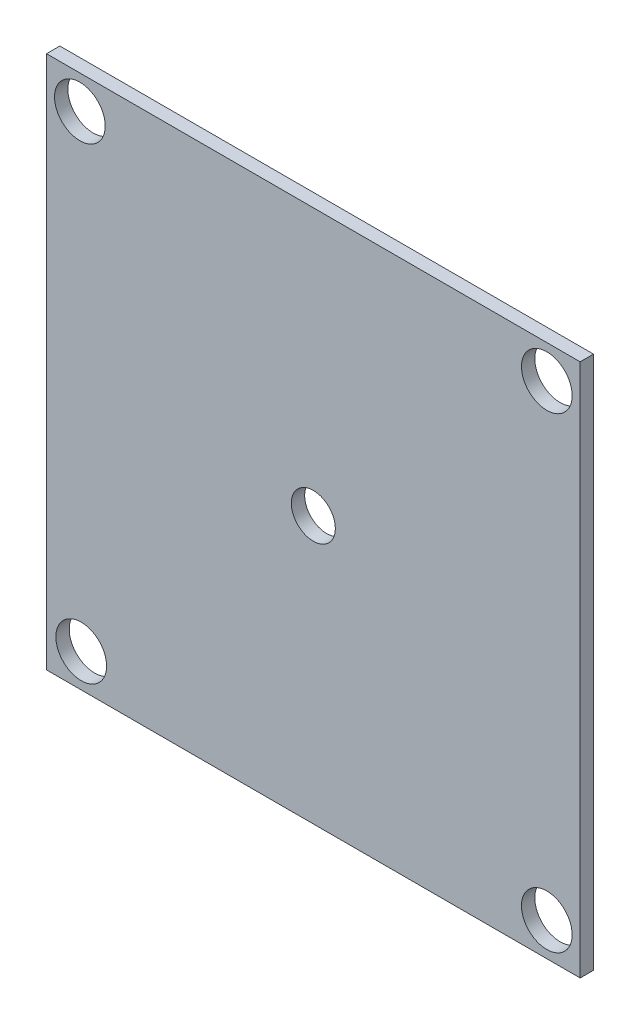
ISO-10303-21;
HEADER;
FILE_DESCRIPTION(('STEP AP214'),'2;1');
FILE_NAME('part.step','',(''),(''),'','','');
FILE_SCHEMA(('AUTOMOTIVE_DESIGN { 1 0 10303 214 1 1 1 1 }'));
ENDSEC;
DATA;
#1=APPLICATION_CONTEXT('core data for automotive mechanical design processes');
#2=APPLICATION_PROTOCOL_DEFINITION('international standard','automotive_design',2000,#1);
#3=PRODUCT_CONTEXT('',#1,'mechanical');
#4=PRODUCT('Part','Part','',(#3));
#5=PRODUCT_RELATED_PRODUCT_CATEGORY('part','',(#4));
#6=PRODUCT_DEFINITION_FORMATION('','',#4);
#7=PRODUCT_DEFINITION_CONTEXT('part definition',#1,'design');
#8=PRODUCT_DEFINITION('design','',#6,#7);
#9=PRODUCT_DEFINITION_SHAPE('','',#8);
#10=(LENGTH_UNIT() NAMED_UNIT(*) SI_UNIT(.MILLI.,.METRE.));
#11=(NAMED_UNIT(*) PLANE_ANGLE_UNIT() SI_UNIT($,.RADIAN.));
#12=(NAMED_UNIT(*) SI_UNIT($,.STERADIAN.) SOLID_ANGLE_UNIT());
#13=UNCERTAINTY_MEASURE_WITH_UNIT(LENGTH_MEASURE(1.E-05),#10,'distance_accuracy_value','');
#14=(GEOMETRIC_REPRESENTATION_CONTEXT(3) GLOBAL_UNCERTAINTY_ASSIGNED_CONTEXT((#13)) GLOBAL_UNIT_ASSIGNED_CONTEXT((#10,
#11,#12)) REPRESENTATION_CONTEXT('',''));
#15=CARTESIAN_POINT('',(0.,0.,0.));
#16=DIRECTION('',(0.,0.,1.));
#17=DIRECTION('',(1.,0.,0.));
#18=AXIS2_PLACEMENT_3D('',#15,#16,#17);
#19=CARTESIAN_POINT('',(-50.8,-50.8,2.54));
#20=DIRECTION('',(1.,0.,0.));
#21=DIRECTION('',(0.,0.,-1.));
#22=AXIS2_PLACEMENT_3D('',#19,#20,#21);
#23=PLANE('',#22);
#24=DIRECTION('',(0.,-1.,0.));
#25=VECTOR('',#24,1.);
#26=CARTESIAN_POINT('',(-50.8,-50.8,0.));
#27=LINE('',#26,#25);
#28=CARTESIAN_POINT('',(-50.8,50.8,0.));
#29=VERTEX_POINT('',#28);
#30=CARTESIAN_POINT('',(-50.8,-50.8,0.));
#31=VERTEX_POINT('',#30);
#32=EDGE_CURVE('E96',#29,#31,#27,.T.);
#33=ORIENTED_EDGE('',*,*,#32,.T.);
#34=DIRECTION('',(0.,0.,-1.));
#35=VECTOR('',#34,1.);
#36=CARTESIAN_POINT('',(-50.8,-50.8,2.54));
#37=LINE('',#36,#35);
#38=CARTESIAN_POINT('',(-50.8,-50.8,2.54));
#39=VERTEX_POINT('',#38);
#40=EDGE_CURVE('E11',#39,#31,#37,.T.);
#41=ORIENTED_EDGE('',*,*,#40,.F.);
#42=DIRECTION('',(0.,-1.,0.));
#43=VECTOR('',#42,1.);
#44=CARTESIAN_POINT('',(-50.8,-50.8,2.54));
#45=LINE('',#44,#43);
#46=CARTESIAN_POINT('',(-50.8,50.8,2.54));
#47=VERTEX_POINT('',#46);
#48=EDGE_CURVE('E84',#47,#39,#45,.T.);
#49=ORIENTED_EDGE('',*,*,#48,.F.);
#50=DIRECTION('',(0.,0.,-1.));
#51=VECTOR('',#50,1.);
#52=CARTESIAN_POINT('',(-50.8,50.8,2.54));
#53=LINE('',#52,#51);
#54=EDGE_CURVE('E92',#47,#29,#53,.T.);
#55=ORIENTED_EDGE('',*,*,#54,.T.);
#56=EDGE_LOOP('',(#33,#41,#49,#55));
#57=FACE_BOUND('',#56,.T.);
#58=ADVANCED_FACE('F33',(#57),#23,.F.);
#59=CARTESIAN_POINT('',(50.8,-50.8,2.54));
#60=DIRECTION('',(0.,1.,0.));
#61=DIRECTION('',(-1.,0.,0.));
#62=AXIS2_PLACEMENT_3D('',#59,#60,#61);
#63=PLANE('',#62);
#64=DIRECTION('',(1.,0.,0.));
#65=VECTOR('',#64,1.);
#66=CARTESIAN_POINT('',(50.8,-50.8,0.));
#67=LINE('',#66,#65);
#68=CARTESIAN_POINT('',(50.8,-50.8,0.));
#69=VERTEX_POINT('',#68);
#70=EDGE_CURVE('E88',#31,#69,#67,.T.);
#71=ORIENTED_EDGE('',*,*,#70,.T.);
#72=DIRECTION('',(0.,0.,-1.));
#73=VECTOR('',#72,1.);
#74=CARTESIAN_POINT('',(50.8,-50.8,2.54));
#75=LINE('',#74,#73);
#76=CARTESIAN_POINT('',(50.8,-50.8,2.54));
#77=VERTEX_POINT('',#76);
#78=EDGE_CURVE('E41',#77,#69,#75,.T.);
#79=ORIENTED_EDGE('',*,*,#78,.F.);
#80=DIRECTION('',(1.,0.,0.));
#81=VECTOR('',#80,1.);
#82=CARTESIAN_POINT('',(50.8,-50.8,2.54));
#83=LINE('',#82,#81);
#84=EDGE_CURVE('E79',#39,#77,#83,.T.);
#85=ORIENTED_EDGE('',*,*,#84,.F.);
#86=ORIENTED_EDGE('',*,*,#40,.T.);
#87=EDGE_LOOP('',(#71,#79,#85,#86));
#88=FACE_BOUND('',#87,.T.);
#89=ADVANCED_FACE('F87',(#88),#63,.F.);
#90=CARTESIAN_POINT('',(50.8,-50.8,2.54));
#91=DIRECTION('',(-1.,0.,0.));
#92=DIRECTION('',(0.,0.,1.));
#93=AXIS2_PLACEMENT_3D('',#90,#91,#92);
#94=PLANE('',#93);
#95=DIRECTION('',(0.,1.,0.));
#96=VECTOR('',#95,1.);
#97=CARTESIAN_POINT('',(50.8,-50.8,0.));
#98=LINE('',#97,#96);
#99=CARTESIAN_POINT('',(50.8,50.8,0.));
#100=VERTEX_POINT('',#99);
#101=EDGE_CURVE('E66',#69,#100,#98,.T.);
#102=ORIENTED_EDGE('',*,*,#101,.T.);
#103=DIRECTION('',(0.,0.,-1.));
#104=VECTOR('',#103,1.);
#105=CARTESIAN_POINT('',(50.8,50.8,2.54));
#106=LINE('',#105,#104);
#107=CARTESIAN_POINT('',(50.8,50.8,2.54));
#108=VERTEX_POINT('',#107);
#109=EDGE_CURVE('E89',#108,#100,#106,.T.);
#110=ORIENTED_EDGE('',*,*,#109,.F.);
#111=DIRECTION('',(0.,1.,0.));
#112=VECTOR('',#111,1.);
#113=CARTESIAN_POINT('',(50.8,-50.8,2.54));
#114=LINE('',#113,#112);
#115=EDGE_CURVE('E82',#77,#108,#114,.T.);
#116=ORIENTED_EDGE('',*,*,#115,.F.);
#117=ORIENTED_EDGE('',*,*,#78,.T.);
#118=EDGE_LOOP('',(#102,#110,#116,#117));
#119=FACE_BOUND('',#118,.T.);
#120=ADVANCED_FACE('F90',(#119),#94,.F.);
#121=CARTESIAN_POINT('',(50.8,50.8,2.54));
#122=DIRECTION('',(0.,-1.,0.));
#123=DIRECTION('',(1.,0.,0.));
#124=AXIS2_PLACEMENT_3D('',#121,#122,#123);
#125=PLANE('',#124);
#126=DIRECTION('',(-1.,0.,0.));
#127=VECTOR('',#126,1.);
#128=CARTESIAN_POINT('',(50.8,50.8,0.));
#129=LINE('',#128,#127);
#130=EDGE_CURVE('E72',#100,#29,#129,.T.);
#131=ORIENTED_EDGE('',*,*,#130,.T.);
#132=ORIENTED_EDGE('',*,*,#54,.F.);
#133=DIRECTION('',(-1.,0.,0.));
#134=VECTOR('',#133,1.);
#135=CARTESIAN_POINT('',(50.8,50.8,2.54));
#136=LINE('',#135,#134);
#137=EDGE_CURVE('E49',#108,#47,#136,.T.);
#138=ORIENTED_EDGE('',*,*,#137,.F.);
#139=ORIENTED_EDGE('',*,*,#109,.T.);
#140=EDGE_LOOP('',(#131,#132,#138,#139));
#141=FACE_BOUND('',#140,.T.);
#142=ADVANCED_FACE('F104',(#141),#125,.F.);
#143=CARTESIAN_POINT('',(0.,0.,2.54));
#144=DIRECTION('',(0.,0.,1.));
#145=DIRECTION('',(1.,0.,0.));
#146=AXIS2_PLACEMENT_3D('',#143,#144,#145);
#147=PLANE('',#146);
#148=CARTESIAN_POINT('',(-44.45,44.45,2.54));
#149=DIRECTION('',(0.,0.,1.));
#150=DIRECTION('',(1.,0.,0.));
#151=AXIS2_PLACEMENT_3D('',#148,#149,#150);
#152=CIRCLE('',#151,4.826);
#153=CARTESIAN_POINT('',(-39.624,44.45,2.54));
#154=VERTEX_POINT('',#153);
#155=EDGE_CURVE('E119',#154,#154,#152,.T.);
#156=ORIENTED_EDGE('',*,*,#155,.F.);
#157=EDGE_LOOP('',(#156));
#158=FACE_BOUND('',#157,.T.);
#159=CARTESIAN_POINT('',(44.45,44.45,2.54));
#160=DIRECTION('',(0.,0.,1.));
#161=DIRECTION('',(1.,0.,0.));
#162=AXIS2_PLACEMENT_3D('',#159,#160,#161);
#163=CIRCLE('',#162,4.826);
#164=CARTESIAN_POINT('',(49.276,44.45,2.54));
#165=VERTEX_POINT('',#164);
#166=EDGE_CURVE('E131',#165,#165,#163,.T.);
#167=ORIENTED_EDGE('',*,*,#166,.F.);
#168=EDGE_LOOP('',(#167));
#169=FACE_BOUND('',#168,.T.);
#170=CARTESIAN_POINT('',(44.45,-44.45,2.54));
#171=DIRECTION('',(0.,0.,1.));
#172=DIRECTION('',(1.,0.,0.));
#173=AXIS2_PLACEMENT_3D('',#170,#171,#172);
#174=CIRCLE('',#173,4.826);
#175=CARTESIAN_POINT('',(49.276,-44.45,2.54));
#176=VERTEX_POINT('',#175);
#177=EDGE_CURVE('E125',#176,#176,#174,.T.);
#178=ORIENTED_EDGE('',*,*,#177,.F.);
#179=EDGE_LOOP('',(#178));
#180=FACE_BOUND('',#179,.T.);
#181=CARTESIAN_POINT('',(-44.1907798423424,-44.45,2.54));
#182=DIRECTION('',(0.,0.,1.));
#183=DIRECTION('',(1.,0.,0.));
#184=AXIS2_PLACEMENT_3D('',#181,#182,#183);
#185=CIRCLE('',#184,4.826);
#186=CARTESIAN_POINT('',(-39.3647798423424,-44.45,2.54));
#187=VERTEX_POINT('',#186);
#188=EDGE_CURVE('E116',#187,#187,#185,.T.);
#189=ORIENTED_EDGE('',*,*,#188,.F.);
#190=EDGE_LOOP('',(#189));
#191=FACE_BOUND('',#190,.T.);
#192=CARTESIAN_POINT('',(0.,0.,2.54));
#193=DIRECTION('',(0.,0.,1.));
#194=DIRECTION('',(1.,0.,0.));
#195=AXIS2_PLACEMENT_3D('',#192,#193,#194);
#196=CIRCLE('',#195,4.191);
#197=CARTESIAN_POINT('',(4.191,0.,2.54));
#198=VERTEX_POINT('',#197);
#199=EDGE_CURVE('E110',#198,#198,#196,.T.);
#200=ORIENTED_EDGE('',*,*,#199,.F.);
#201=EDGE_LOOP('',(#200));
#202=FACE_BOUND('',#201,.T.);
#203=ORIENTED_EDGE('',*,*,#48,.T.);
#204=ORIENTED_EDGE('',*,*,#84,.T.);
#205=ORIENTED_EDGE('',*,*,#115,.T.);
#206=ORIENTED_EDGE('',*,*,#137,.T.);
#207=EDGE_LOOP('',(#203,#204,#205,#206));
#208=FACE_BOUND('',#207,.T.);
#209=ADVANCED_FACE('F80',(#158,#169,#180,#191,#202,#208),#147,.T.);
#210=CARTESIAN_POINT('',(0.,0.,0.));
#211=DIRECTION('',(0.,0.,1.));
#212=DIRECTION('',(1.,0.,0.));
#213=AXIS2_PLACEMENT_3D('',#210,#211,#212);
#214=PLANE('',#213);
#215=CARTESIAN_POINT('',(-44.45,44.45,0.));
#216=DIRECTION('',(0.,0.,1.));
#217=DIRECTION('',(1.,0.,0.));
#218=AXIS2_PLACEMENT_3D('',#215,#216,#217);
#219=CIRCLE('',#218,4.826);
#220=CARTESIAN_POINT('',(-39.624,44.45,0.));
#221=VERTEX_POINT('',#220);
#222=EDGE_CURVE('E134',#221,#221,#219,.T.);
#223=ORIENTED_EDGE('',*,*,#222,.T.);
#224=EDGE_LOOP('',(#223));
#225=FACE_BOUND('',#224,.T.);
#226=CARTESIAN_POINT('',(44.45,44.45,0.));
#227=DIRECTION('',(0.,0.,1.));
#228=DIRECTION('',(1.,0.,0.));
#229=AXIS2_PLACEMENT_3D('',#226,#227,#228);
#230=CIRCLE('',#229,4.826);
#231=CARTESIAN_POINT('',(49.276,44.45,0.));
#232=VERTEX_POINT('',#231);
#233=EDGE_CURVE('E128',#232,#232,#230,.T.);
#234=ORIENTED_EDGE('',*,*,#233,.T.);
#235=EDGE_LOOP('',(#234));
#236=FACE_BOUND('',#235,.T.);
#237=CARTESIAN_POINT('',(44.45,-44.45,0.));
#238=DIRECTION('',(0.,0.,1.));
#239=DIRECTION('',(1.,0.,0.));
#240=AXIS2_PLACEMENT_3D('',#237,#238,#239);
#241=CIRCLE('',#240,4.826);
#242=CARTESIAN_POINT('',(49.276,-44.45,0.));
#243=VERTEX_POINT('',#242);
#244=EDGE_CURVE('E122',#243,#243,#241,.T.);
#245=ORIENTED_EDGE('',*,*,#244,.T.);
#246=EDGE_LOOP('',(#245));
#247=FACE_BOUND('',#246,.T.);
#248=CARTESIAN_POINT('',(-44.1907798423424,-44.45,0.));
#249=DIRECTION('',(0.,0.,1.));
#250=DIRECTION('',(1.,0.,0.));
#251=AXIS2_PLACEMENT_3D('',#248,#249,#250);
#252=CIRCLE('',#251,4.826);
#253=CARTESIAN_POINT('',(-39.3647798423424,-44.45,0.));
#254=VERTEX_POINT('',#253);
#255=EDGE_CURVE('E113',#254,#254,#252,.T.);
#256=ORIENTED_EDGE('',*,*,#255,.T.);
#257=EDGE_LOOP('',(#256));
#258=FACE_BOUND('',#257,.T.);
#259=CARTESIAN_POINT('',(0.,0.,0.));
#260=DIRECTION('',(0.,0.,1.));
#261=DIRECTION('',(1.,0.,0.));
#262=AXIS2_PLACEMENT_3D('',#259,#260,#261);
#263=CIRCLE('',#262,4.191);
#264=CARTESIAN_POINT('',(4.191,0.,0.));
#265=VERTEX_POINT('',#264);
#266=EDGE_CURVE('E99',#265,#265,#263,.T.);
#267=ORIENTED_EDGE('',*,*,#266,.T.);
#268=EDGE_LOOP('',(#267));
#269=FACE_BOUND('',#268,.T.);
#270=ORIENTED_EDGE('',*,*,#32,.F.);
#271=ORIENTED_EDGE('',*,*,#130,.F.);
#272=ORIENTED_EDGE('',*,*,#101,.F.);
#273=ORIENTED_EDGE('',*,*,#70,.F.);
#274=EDGE_LOOP('',(#270,#271,#272,#273));
#275=FACE_BOUND('',#274,.T.);
#276=ADVANCED_FACE('F107',(#225,#236,#247,#258,#269,#275),#214,.F.);
#277=CARTESIAN_POINT('',(0.,0.,0.));
#278=DIRECTION('',(0.,0.,1.));
#279=DIRECTION('',(1.,0.,0.));
#280=AXIS2_PLACEMENT_3D('',#277,#278,#279);
#281=CYLINDRICAL_SURFACE('',#280,4.191);
#282=ORIENTED_EDGE('',*,*,#266,.F.);
#283=EDGE_LOOP('',(#282));
#284=FACE_BOUND('',#283,.T.);
#285=ORIENTED_EDGE('',*,*,#199,.T.);
#286=EDGE_LOOP('',(#285));
#287=FACE_BOUND('',#286,.T.);
#288=ADVANCED_FACE('F153',(#284,#287),#281,.F.);
#289=CARTESIAN_POINT('',(-44.1907798423424,-44.45,0.));
#290=DIRECTION('',(0.,0.,1.));
#291=DIRECTION('',(1.,0.,0.));
#292=AXIS2_PLACEMENT_3D('',#289,#290,#291);
#293=CYLINDRICAL_SURFACE('',#292,4.826);
#294=ORIENTED_EDGE('',*,*,#255,.F.);
#295=EDGE_LOOP('',(#294));
#296=FACE_BOUND('',#295,.T.);
#297=ORIENTED_EDGE('',*,*,#188,.T.);
#298=EDGE_LOOP('',(#297));
#299=FACE_BOUND('',#298,.T.);
#300=ADVANCED_FACE('F155',(#296,#299),#293,.F.);
#301=CARTESIAN_POINT('',(44.45,-44.45,0.));
#302=DIRECTION('',(0.,0.,1.));
#303=DIRECTION('',(1.,0.,0.));
#304=AXIS2_PLACEMENT_3D('',#301,#302,#303);
#305=CYLINDRICAL_SURFACE('',#304,4.826);
#306=ORIENTED_EDGE('',*,*,#244,.F.);
#307=EDGE_LOOP('',(#306));
#308=FACE_BOUND('',#307,.T.);
#309=ORIENTED_EDGE('',*,*,#177,.T.);
#310=EDGE_LOOP('',(#309));
#311=FACE_BOUND('',#310,.T.);
#312=ADVANCED_FACE('F162',(#308,#311),#305,.F.);
#313=CARTESIAN_POINT('',(44.45,44.45,0.));
#314=DIRECTION('',(0.,0.,1.));
#315=DIRECTION('',(1.,0.,0.));
#316=AXIS2_PLACEMENT_3D('',#313,#314,#315);
#317=CYLINDRICAL_SURFACE('',#316,4.826);
#318=ORIENTED_EDGE('',*,*,#233,.F.);
#319=EDGE_LOOP('',(#318));
#320=FACE_BOUND('',#319,.T.);
#321=ORIENTED_EDGE('',*,*,#166,.T.);
#322=EDGE_LOOP('',(#321));
#323=FACE_BOUND('',#322,.T.);
#324=ADVANCED_FACE('F206',(#320,#323),#317,.F.);
#325=CARTESIAN_POINT('',(-44.45,44.45,0.));
#326=DIRECTION('',(0.,0.,1.));
#327=DIRECTION('',(1.,0.,0.));
#328=AXIS2_PLACEMENT_3D('',#325,#326,#327);
#329=CYLINDRICAL_SURFACE('',#328,4.826);
#330=ORIENTED_EDGE('',*,*,#222,.F.);
#331=EDGE_LOOP('',(#330));
#332=FACE_BOUND('',#331,.T.);
#333=ORIENTED_EDGE('',*,*,#155,.T.);
#334=EDGE_LOOP('',(#333));
#335=FACE_BOUND('',#334,.T.);
#336=ADVANCED_FACE('F140',(#332,#335),#329,.F.);
#337=CLOSED_SHELL('',(#58,#89,#120,#142,#209,#276,#288,#300,#312,#324,#336));
#338=MANIFOLD_SOLID_BREP('B2',#337);
#339=ADVANCED_BREP_SHAPE_REPRESENTATION('',(#18,#338),#14);
#340=SHAPE_DEFINITION_REPRESENTATION(#9,#339);
ENDSEC;
END-ISO-10303-21;
